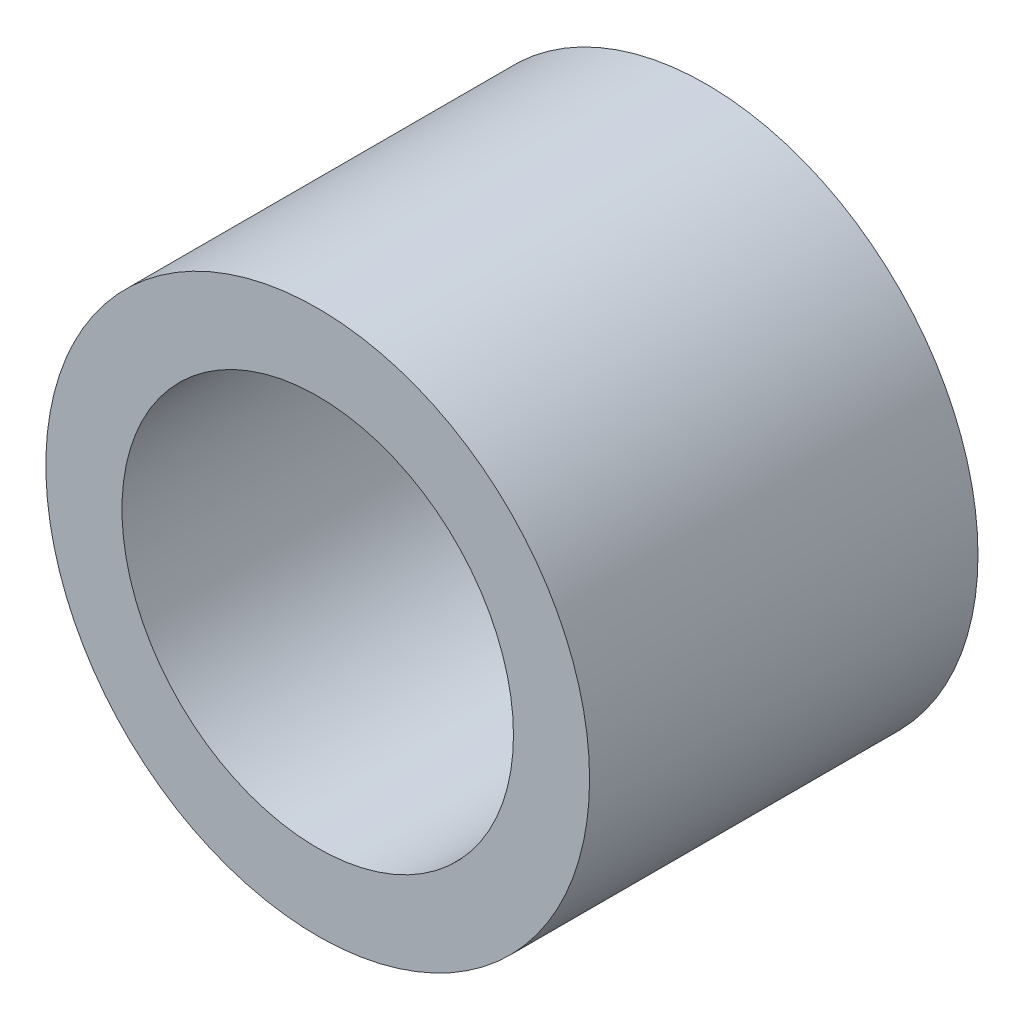
ISO-10303-21;
HEADER;
FILE_DESCRIPTION(('STEP AP214'),'2;1');
FILE_NAME('part.step','',(''),(''),'','','');
FILE_SCHEMA(('AUTOMOTIVE_DESIGN { 1 0 10303 214 1 1 1 1 }'));
ENDSEC;
DATA;
#1=APPLICATION_CONTEXT('core data for automotive mechanical design processes');
#2=APPLICATION_PROTOCOL_DEFINITION('international standard','automotive_design',2000,#1);
#3=PRODUCT_CONTEXT('',#1,'mechanical');
#4=PRODUCT('Part','Part','',(#3));
#5=PRODUCT_RELATED_PRODUCT_CATEGORY('part','',(#4));
#6=PRODUCT_DEFINITION_FORMATION('','',#4);
#7=PRODUCT_DEFINITION_CONTEXT('part definition',#1,'design');
#8=PRODUCT_DEFINITION('design','',#6,#7);
#9=PRODUCT_DEFINITION_SHAPE('','',#8);
#10=(LENGTH_UNIT() NAMED_UNIT(*) SI_UNIT(.MILLI.,.METRE.));
#11=(NAMED_UNIT(*) PLANE_ANGLE_UNIT() SI_UNIT($,.RADIAN.));
#12=(NAMED_UNIT(*) SI_UNIT($,.STERADIAN.) SOLID_ANGLE_UNIT());
#13=UNCERTAINTY_MEASURE_WITH_UNIT(LENGTH_MEASURE(1.E-05),#10,'distance_accuracy_value','');
#14=(GEOMETRIC_REPRESENTATION_CONTEXT(3) GLOBAL_UNCERTAINTY_ASSIGNED_CONTEXT((#13)) GLOBAL_UNIT_ASSIGNED_CONTEXT((#10,
#11,#12)) REPRESENTATION_CONTEXT('',''));
#15=CARTESIAN_POINT('',(0.,0.,0.));
#16=DIRECTION('',(0.,0.,1.));
#17=DIRECTION('',(1.,0.,0.));
#18=AXIS2_PLACEMENT_3D('',#15,#16,#17);
#19=CARTESIAN_POINT('',(0.,0.,7.9375));
#20=DIRECTION('',(0.,0.,1.));
#21=DIRECTION('',(1.,0.,0.));
#22=AXIS2_PLACEMENT_3D('',#19,#20,#21);
#23=PLANE('',#22);
#24=CARTESIAN_POINT('',(0.,0.,7.9375));
#25=DIRECTION('',(0.,0.,1.));
#26=DIRECTION('',(1.,0.,0.));
#27=AXIS2_PLACEMENT_3D('',#24,#25,#26);
#28=CIRCLE('',#27,11.1125);
#29=CARTESIAN_POINT('',(11.1125,0.,7.9375));
#30=VERTEX_POINT('',#29);
#31=EDGE_CURVE('E10',#30,#30,#28,.T.);
#32=ORIENTED_EDGE('',*,*,#31,.T.);
#33=EDGE_LOOP('',(#32));
#34=FACE_BOUND('',#33,.T.);
#35=CARTESIAN_POINT('',(0.,0.,7.9375));
#36=DIRECTION('',(0.,0.,1.));
#37=DIRECTION('',(1.,0.,0.));
#38=AXIS2_PLACEMENT_3D('',#35,#36,#37);
#39=CIRCLE('',#38,8.001);
#40=CARTESIAN_POINT('',(8.001,0.,7.9375));
#41=VERTEX_POINT('',#40);
#42=EDGE_CURVE('E41',#41,#41,#39,.T.);
#43=ORIENTED_EDGE('',*,*,#42,.F.);
#44=EDGE_LOOP('',(#43));
#45=FACE_BOUND('',#44,.T.);
#46=ADVANCED_FACE('F30',(#34,#45),#23,.T.);
#47=CARTESIAN_POINT('',(0.,0.,-7.9375));
#48=DIRECTION('',(0.,0.,1.));
#49=DIRECTION('',(1.,0.,0.));
#50=AXIS2_PLACEMENT_3D('',#47,#48,#49);
#51=PLANE('',#50);
#52=CARTESIAN_POINT('',(0.,0.,-7.9375));
#53=DIRECTION('',(0.,0.,1.));
#54=DIRECTION('',(1.,0.,0.));
#55=AXIS2_PLACEMENT_3D('',#52,#53,#54);
#56=CIRCLE('',#55,11.1125);
#57=CARTESIAN_POINT('',(11.1125,0.,-7.9375));
#58=VERTEX_POINT('',#57);
#59=EDGE_CURVE('E34',#58,#58,#56,.T.);
#60=ORIENTED_EDGE('',*,*,#59,.F.);
#61=EDGE_LOOP('',(#60));
#62=FACE_BOUND('',#61,.T.);
#63=CARTESIAN_POINT('',(0.,0.,-7.9375));
#64=DIRECTION('',(0.,0.,1.));
#65=DIRECTION('',(1.,0.,0.));
#66=AXIS2_PLACEMENT_3D('',#63,#64,#65);
#67=CIRCLE('',#66,8.001);
#68=CARTESIAN_POINT('',(8.001,0.,-7.9375));
#69=VERTEX_POINT('',#68);
#70=EDGE_CURVE('E43',#69,#69,#67,.T.);
#71=ORIENTED_EDGE('',*,*,#70,.T.);
#72=EDGE_LOOP('',(#71));
#73=FACE_BOUND('',#72,.T.);
#74=ADVANCED_FACE('F53',(#62,#73),#51,.F.);
#75=CARTESIAN_POINT('',(0.,0.,7.9375));
#76=DIRECTION('',(0.,0.,-1.));
#77=DIRECTION('',(-1.,0.,0.));
#78=AXIS2_PLACEMENT_3D('',#75,#76,#77);
#79=CYLINDRICAL_SURFACE('',#78,11.1125);
#80=ORIENTED_EDGE('',*,*,#31,.F.);
#81=EDGE_LOOP('',(#80));
#82=FACE_BOUND('',#81,.T.);
#83=ORIENTED_EDGE('',*,*,#59,.T.);
#84=EDGE_LOOP('',(#83));
#85=FACE_BOUND('',#84,.T.);
#86=ADVANCED_FACE('F32',(#82,#85),#79,.T.);
#87=CARTESIAN_POINT('',(0.,0.,7.9375));
#88=DIRECTION('',(0.,0.,-1.));
#89=DIRECTION('',(-1.,0.,0.));
#90=AXIS2_PLACEMENT_3D('',#87,#88,#89);
#91=CYLINDRICAL_SURFACE('',#90,8.001);
#92=ORIENTED_EDGE('',*,*,#42,.T.);
#93=EDGE_LOOP('',(#92));
#94=FACE_BOUND('',#93,.T.);
#95=ORIENTED_EDGE('',*,*,#70,.F.);
#96=EDGE_LOOP('',(#95));
#97=FACE_BOUND('',#96,.T.);
#98=ADVANCED_FACE('F49',(#94,#97),#91,.F.);
#99=CLOSED_SHELL('',(#46,#74,#86,#98));
#100=MANIFOLD_SOLID_BREP('B2',#99);
#101=ADVANCED_BREP_SHAPE_REPRESENTATION('',(#18,#100),#14);
#102=SHAPE_DEFINITION_REPRESENTATION(#9,#101);
ENDSEC;
END-ISO-10303-21;
